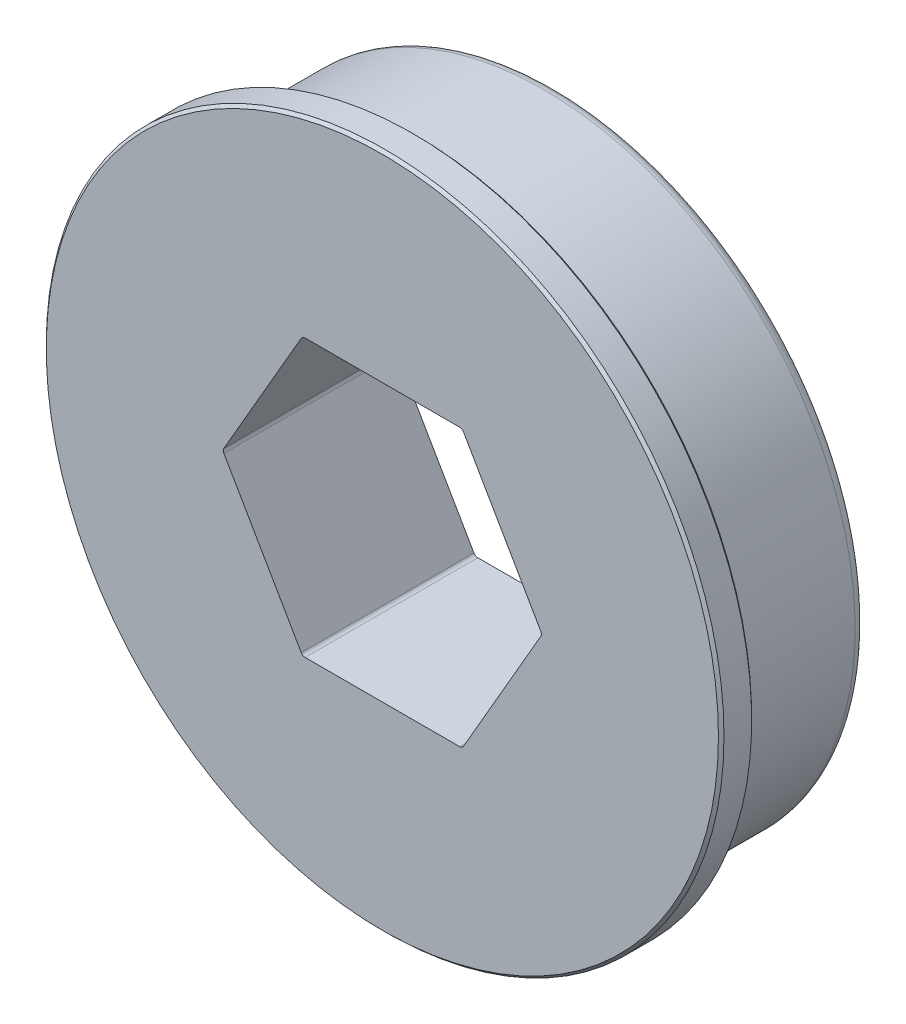
ISO-10303-21;
HEADER;
FILE_DESCRIPTION(('STEP AP214'),'2;1');
FILE_NAME('part.step','',(''),(''),'','','');
FILE_SCHEMA(('AUTOMOTIVE_DESIGN { 1 0 10303 214 1 1 1 1 }'));
ENDSEC;
DATA;
#1=APPLICATION_CONTEXT('core data for automotive mechanical design processes');
#2=APPLICATION_PROTOCOL_DEFINITION('international standard','automotive_design',2000,#1);
#3=PRODUCT_CONTEXT('',#1,'mechanical');
#4=PRODUCT('Part','Part','',(#3));
#5=PRODUCT_RELATED_PRODUCT_CATEGORY('part','',(#4));
#6=PRODUCT_DEFINITION_FORMATION('','',#4);
#7=PRODUCT_DEFINITION_CONTEXT('part definition',#1,'design');
#8=PRODUCT_DEFINITION('design','',#6,#7);
#9=PRODUCT_DEFINITION_SHAPE('','',#8);
#10=(LENGTH_UNIT() NAMED_UNIT(*) SI_UNIT(.MILLI.,.METRE.));
#11=(NAMED_UNIT(*) PLANE_ANGLE_UNIT() SI_UNIT($,.RADIAN.));
#12=(NAMED_UNIT(*) SI_UNIT($,.STERADIAN.) SOLID_ANGLE_UNIT());
#13=UNCERTAINTY_MEASURE_WITH_UNIT(LENGTH_MEASURE(1.E-05),#10,'distance_accuracy_value','');
#14=(GEOMETRIC_REPRESENTATION_CONTEXT(3) GLOBAL_UNCERTAINTY_ASSIGNED_CONTEXT((#13)) GLOBAL_UNIT_ASSIGNED_CONTEXT((#10,
#11,#12)) REPRESENTATION_CONTEXT('',''));
#15=CARTESIAN_POINT('',(0.,0.,0.));
#16=DIRECTION('',(0.,0.,1.));
#17=DIRECTION('',(1.,0.,0.));
#18=AXIS2_PLACEMENT_3D('',#15,#16,#17);
#19=CARTESIAN_POINT('',(0.,0.,7.92734));
#20=DIRECTION('',(0.,0.,-1.));
#21=DIRECTION('',(-1.,0.,0.));
#22=AXIS2_PLACEMENT_3D('',#19,#20,#21);
#23=CYLINDRICAL_SURFACE('',#22,15.5575);
#24=CARTESIAN_POINT('',(0.,0.,7.80034));
#25=DIRECTION('',(0.,0.,1.));
#26=DIRECTION('',(1.,0.,0.));
#27=AXIS2_PLACEMENT_3D('',#24,#25,#26);
#28=CIRCLE('',#27,15.5575);
#29=CARTESIAN_POINT('',(15.5575,0.,7.80034));
#30=VERTEX_POINT('',#29);
#31=EDGE_CURVE('E182',#30,#30,#28,.F.);
#32=ORIENTED_EDGE('',*,*,#31,.T.);
#33=EDGE_LOOP('',(#32));
#34=FACE_BOUND('',#33,.T.);
#35=CARTESIAN_POINT('',(0.,0.,6.53034000000001));
#36=DIRECTION('',(0.,0.,-1.));
#37=DIRECTION('',(-1.,0.,0.));
#38=AXIS2_PLACEMENT_3D('',#35,#36,#37);
#39=CIRCLE('',#38,15.5575);
#40=CARTESIAN_POINT('',(-15.5575,0.,6.53034000000001));
#41=VERTEX_POINT('',#40);
#42=EDGE_CURVE('E179',#41,#41,#39,.F.);
#43=ORIENTED_EDGE('',*,*,#42,.T.);
#44=EDGE_LOOP('',(#43));
#45=FACE_BOUND('',#44,.T.);
#46=ADVANCED_FACE('F32',(#34,#45),#23,.T.);
#47=CARTESIAN_POINT('',(15.5575,0.,7.92734));
#48=DIRECTION('',(0.,0.,1.));
#49=DIRECTION('',(1.,0.,0.));
#50=AXIS2_PLACEMENT_3D('',#47,#48,#49);
#51=PLANE('',#50);
#52=CARTESIAN_POINT('',(0.,0.,7.92734));
#53=DIRECTION('',(0.,0.,1.));
#54=DIRECTION('',(1.,0.,0.));
#55=AXIS2_PLACEMENT_3D('',#52,#53,#54);
#56=CIRCLE('',#55,15.4305);
#57=CARTESIAN_POINT('',(15.4305,0.,7.92734));
#58=VERTEX_POINT('',#57);
#59=EDGE_CURVE('E185',#58,#58,#56,.T.);
#60=ORIENTED_EDGE('',*,*,#59,.T.);
#61=EDGE_LOOP('',(#60));
#62=FACE_BOUND('',#61,.T.);
#63=DIRECTION('',(-0.5,0.866025403784438,0.));
#64=VECTOR('',#63,1.);
#65=CARTESIAN_POINT('',(-3.66617420935411,-6.35000000000001,7.92734));
#66=LINE('',#65,#64);
#67=CARTESIAN_POINT('',(-3.72483299670378,-6.24840000000001,7.92734));
#68=VERTEX_POINT('',#67);
#69=CARTESIAN_POINT('',(-7.27368963135857,-0.101600000000006,7.92734));
#70=VERTEX_POINT('',#69);
#71=EDGE_CURVE('E170',#68,#70,#66,.T.);
#72=ORIENTED_EDGE('',*,*,#71,.T.);
#73=CARTESIAN_POINT('',(-7.09771326930958,0.,7.92734));
#74=DIRECTION('',(0.,0.,1.));
#75=DIRECTION('',(1.,0.,0.));
#76=AXIS2_PLACEMENT_3D('',#73,#74,#75);
#77=CIRCLE('',#76,0.2032);
#78=CARTESIAN_POINT('',(-7.27368963135857,0.101599999999993,7.92734));
#79=VERTEX_POINT('',#78);
#80=EDGE_CURVE('E54',#70,#79,#77,.F.);
#81=ORIENTED_EDGE('',*,*,#80,.T.);
#82=DIRECTION('',(0.5,0.866025403784439,0.));
#83=VECTOR('',#82,1.);
#84=CARTESIAN_POINT('',(-7.33234841870824,0.,7.92734));
#85=LINE('',#84,#83);
#86=CARTESIAN_POINT('',(-3.72483299670379,6.24839999999999,7.92734));
#87=VERTEX_POINT('',#86);
#88=EDGE_CURVE('E165',#79,#87,#85,.T.);
#89=ORIENTED_EDGE('',*,*,#88,.T.);
#90=CARTESIAN_POINT('',(-3.54885663465479,6.14679999999999,7.92734));
#91=DIRECTION('',(0.,0.,1.));
#92=DIRECTION('',(1.,0.,0.));
#93=AXIS2_PLACEMENT_3D('',#90,#91,#92);
#94=CIRCLE('',#93,0.2032);
#95=CARTESIAN_POINT('',(-3.54885663465479,6.34999999999999,7.92734));
#96=VERTEX_POINT('',#95);
#97=EDGE_CURVE('E11',#87,#96,#94,.F.);
#98=ORIENTED_EDGE('',*,*,#97,.T.);
#99=DIRECTION('',(1.,0.,0.));
#100=VECTOR('',#99,1.);
#101=CARTESIAN_POINT('',(-3.66617420935412,6.34999999999999,7.92734));
#102=LINE('',#101,#100);
#103=CARTESIAN_POINT('',(3.5488566346548,6.35,7.92734));
#104=VERTEX_POINT('',#103);
#105=EDGE_CURVE('E238',#96,#104,#102,.T.);
#106=ORIENTED_EDGE('',*,*,#105,.T.);
#107=CARTESIAN_POINT('',(3.5488566346548,6.1468,7.92734));
#108=DIRECTION('',(0.,0.,1.));
#109=DIRECTION('',(1.,0.,0.));
#110=AXIS2_PLACEMENT_3D('',#107,#108,#109);
#111=CIRCLE('',#110,0.2032);
#112=CARTESIAN_POINT('',(3.72483299670379,6.2484,7.92734));
#113=VERTEX_POINT('',#112);
#114=EDGE_CURVE('E132',#104,#113,#111,.F.);
#115=ORIENTED_EDGE('',*,*,#114,.T.);
#116=DIRECTION('',(0.5,-0.866025403784438,0.));
#117=VECTOR('',#116,1.);
#118=CARTESIAN_POINT('',(3.66617420935413,6.35,7.92734));
#119=LINE('',#118,#117);
#120=CARTESIAN_POINT('',(7.27368963135859,0.101599999999997,7.92734));
#121=VERTEX_POINT('',#120);
#122=EDGE_CURVE('E142',#113,#121,#119,.T.);
#123=ORIENTED_EDGE('',*,*,#122,.T.);
#124=CARTESIAN_POINT('',(7.09771326930959,0.,7.92734));
#125=DIRECTION('',(0.,0.,1.));
#126=DIRECTION('',(1.,0.,0.));
#127=AXIS2_PLACEMENT_3D('',#124,#125,#126);
#128=CIRCLE('',#127,0.2032);
#129=CARTESIAN_POINT('',(7.27368963135859,-0.101600000000005,7.92734));
#130=VERTEX_POINT('',#129);
#131=EDGE_CURVE('E218',#121,#130,#128,.F.);
#132=ORIENTED_EDGE('',*,*,#131,.T.);
#133=DIRECTION('',(-0.5,-0.866025403784439,0.));
#134=VECTOR('',#133,1.);
#135=CARTESIAN_POINT('',(7.33234841870825,0.,7.92734));
#136=LINE('',#135,#134);
#137=CARTESIAN_POINT('',(3.7248329967038,-6.24840000000001,7.92734));
#138=VERTEX_POINT('',#137);
#139=EDGE_CURVE('E242',#130,#138,#136,.T.);
#140=ORIENTED_EDGE('',*,*,#139,.T.);
#141=CARTESIAN_POINT('',(3.5488566346548,-6.14680000000001,7.92734));
#142=DIRECTION('',(0.,0.,1.));
#143=DIRECTION('',(1.,0.,0.));
#144=AXIS2_PLACEMENT_3D('',#141,#142,#143);
#145=CIRCLE('',#144,0.2032);
#146=CARTESIAN_POINT('',(3.5488566346548,-6.35000000000001,7.92734));
#147=VERTEX_POINT('',#146);
#148=EDGE_CURVE('E222',#138,#147,#145,.F.);
#149=ORIENTED_EDGE('',*,*,#148,.T.);
#150=DIRECTION('',(-1.,0.,0.));
#151=VECTOR('',#150,1.);
#152=CARTESIAN_POINT('',(3.66617420935413,-6.35000000000001,7.92734));
#153=LINE('',#152,#151);
#154=CARTESIAN_POINT('',(-3.54885663465478,-6.35000000000001,7.92734));
#155=VERTEX_POINT('',#154);
#156=EDGE_CURVE('E248',#147,#155,#153,.T.);
#157=ORIENTED_EDGE('',*,*,#156,.T.);
#158=CARTESIAN_POINT('',(-3.54885663465478,-6.14680000000001,7.92734));
#159=DIRECTION('',(0.,0.,1.));
#160=DIRECTION('',(1.,0.,0.));
#161=AXIS2_PLACEMENT_3D('',#158,#159,#160);
#162=CIRCLE('',#161,0.2032);
#163=EDGE_CURVE('E226',#155,#68,#162,.F.);
#164=ORIENTED_EDGE('',*,*,#163,.T.);
#165=EDGE_LOOP('',(#72,#81,#89,#98,#106,#115,#123,#132,#140,#149,#157,#164));
#166=FACE_BOUND('',#165,.T.);
#167=ADVANCED_FACE('F237',(#62,#166),#51,.T.);
#168=CARTESIAN_POINT('',(0.,0.,0.));
#169=DIRECTION('',(0.,0.,-1.));
#170=DIRECTION('',(-1.,0.,0.));
#171=AXIS2_PLACEMENT_3D('',#168,#169,#170);
#172=PLANE('',#171);
#173=CARTESIAN_POINT('',(0.,0.,0.));
#174=DIRECTION('',(0.,0.,-1.));
#175=DIRECTION('',(-1.,0.,0.));
#176=AXIS2_PLACEMENT_3D('',#173,#174,#175);
#177=CIRCLE('',#176,13.7795);
#178=CARTESIAN_POINT('',(-13.7795,0.,0.));
#179=VERTEX_POINT('',#178);
#180=EDGE_CURVE('E188',#179,#179,#177,.T.);
#181=ORIENTED_EDGE('',*,*,#180,.T.);
#182=EDGE_LOOP('',(#181));
#183=FACE_BOUND('',#182,.T.);
#184=DIRECTION('',(0.5,0.866025403784439,0.));
#185=VECTOR('',#184,1.);
#186=CARTESIAN_POINT('',(-7.33234841870824,0.,0.));
#187=LINE('',#186,#185);
#188=CARTESIAN_POINT('',(-7.27368963135857,0.101599999999993,0.));
#189=VERTEX_POINT('',#188);
#190=CARTESIAN_POINT('',(-3.72483299670379,6.24839999999999,0.));
#191=VERTEX_POINT('',#190);
#192=EDGE_CURVE('E156',#189,#191,#187,.T.);
#193=ORIENTED_EDGE('',*,*,#192,.F.);
#194=CARTESIAN_POINT('',(-7.09771326930958,0.,0.));
#195=DIRECTION('',(0.,0.,-1.));
#196=DIRECTION('',(-1.,0.,0.));
#197=AXIS2_PLACEMENT_3D('',#194,#195,#196);
#198=CIRCLE('',#197,0.2032);
#199=CARTESIAN_POINT('',(-7.27368963135857,-0.101600000000006,0.));
#200=VERTEX_POINT('',#199);
#201=EDGE_CURVE('E228',#189,#200,#198,.F.);
#202=ORIENTED_EDGE('',*,*,#201,.T.);
#203=DIRECTION('',(-0.5,0.866025403784438,0.));
#204=VECTOR('',#203,1.);
#205=CARTESIAN_POINT('',(-3.66617420935411,-6.35000000000001,0.));
#206=LINE('',#205,#204);
#207=CARTESIAN_POINT('',(-3.72483299670378,-6.24840000000001,0.));
#208=VERTEX_POINT('',#207);
#209=EDGE_CURVE('E162',#208,#200,#206,.T.);
#210=ORIENTED_EDGE('',*,*,#209,.F.);
#211=CARTESIAN_POINT('',(-3.54885663465478,-6.14680000000001,0.));
#212=DIRECTION('',(0.,0.,-1.));
#213=DIRECTION('',(-1.,0.,0.));
#214=AXIS2_PLACEMENT_3D('',#211,#212,#213);
#215=CIRCLE('',#214,0.2032);
#216=CARTESIAN_POINT('',(-3.54885663465478,-6.35000000000001,0.));
#217=VERTEX_POINT('',#216);
#218=EDGE_CURVE('E224',#208,#217,#215,.F.);
#219=ORIENTED_EDGE('',*,*,#218,.T.);
#220=DIRECTION('',(-1.,0.,0.));
#221=VECTOR('',#220,1.);
#222=CARTESIAN_POINT('',(3.66617420935413,-6.35000000000001,0.));
#223=LINE('',#222,#221);
#224=CARTESIAN_POINT('',(3.5488566346548,-6.35000000000001,0.));
#225=VERTEX_POINT('',#224);
#226=EDGE_CURVE('E154',#225,#217,#223,.T.);
#227=ORIENTED_EDGE('',*,*,#226,.F.);
#228=CARTESIAN_POINT('',(3.5488566346548,-6.14680000000001,0.));
#229=DIRECTION('',(0.,0.,-1.));
#230=DIRECTION('',(-1.,0.,0.));
#231=AXIS2_PLACEMENT_3D('',#228,#229,#230);
#232=CIRCLE('',#231,0.2032);
#233=CARTESIAN_POINT('',(3.7248329967038,-6.24840000000001,0.));
#234=VERTEX_POINT('',#233);
#235=EDGE_CURVE('E220',#225,#234,#232,.F.);
#236=ORIENTED_EDGE('',*,*,#235,.T.);
#237=DIRECTION('',(-0.5,-0.866025403784439,0.));
#238=VECTOR('',#237,1.);
#239=CARTESIAN_POINT('',(7.33234841870825,0.,0.));
#240=LINE('',#239,#238);
#241=CARTESIAN_POINT('',(7.27368963135859,-0.101600000000005,0.));
#242=VERTEX_POINT('',#241);
#243=EDGE_CURVE('E150',#242,#234,#240,.T.);
#244=ORIENTED_EDGE('',*,*,#243,.F.);
#245=CARTESIAN_POINT('',(7.09771326930959,0.,0.));
#246=DIRECTION('',(0.,0.,-1.));
#247=DIRECTION('',(-1.,0.,0.));
#248=AXIS2_PLACEMENT_3D('',#245,#246,#247);
#249=CIRCLE('',#248,0.2032);
#250=CARTESIAN_POINT('',(7.27368963135859,0.101599999999997,0.));
#251=VERTEX_POINT('',#250);
#252=EDGE_CURVE('E149',#242,#251,#249,.F.);
#253=ORIENTED_EDGE('',*,*,#252,.T.);
#254=DIRECTION('',(0.5,-0.866025403784438,0.));
#255=VECTOR('',#254,1.);
#256=CARTESIAN_POINT('',(3.66617420935413,6.35,0.));
#257=LINE('',#256,#255);
#258=CARTESIAN_POINT('',(3.72483299670379,6.2484,0.));
#259=VERTEX_POINT('',#258);
#260=EDGE_CURVE('E139',#259,#251,#257,.T.);
#261=ORIENTED_EDGE('',*,*,#260,.F.);
#262=CARTESIAN_POINT('',(3.5488566346548,6.1468,0.));
#263=DIRECTION('',(0.,0.,-1.));
#264=DIRECTION('',(-1.,0.,0.));
#265=AXIS2_PLACEMENT_3D('',#262,#263,#264);
#266=CIRCLE('',#265,0.2032);
#267=CARTESIAN_POINT('',(3.5488566346548,6.35,0.));
#268=VERTEX_POINT('',#267);
#269=EDGE_CURVE('E122',#259,#268,#266,.F.);
#270=ORIENTED_EDGE('',*,*,#269,.T.);
#271=DIRECTION('',(1.,0.,0.));
#272=VECTOR('',#271,1.);
#273=CARTESIAN_POINT('',(-3.66617420935412,6.34999999999999,0.));
#274=LINE('',#273,#272);
#275=CARTESIAN_POINT('',(-3.54885663465479,6.34999999999999,0.));
#276=VERTEX_POINT('',#275);
#277=EDGE_CURVE('E151',#276,#268,#274,.T.);
#278=ORIENTED_EDGE('',*,*,#277,.F.);
#279=CARTESIAN_POINT('',(-3.54885663465479,6.14679999999999,0.));
#280=DIRECTION('',(0.,0.,-1.));
#281=DIRECTION('',(-1.,0.,0.));
#282=AXIS2_PLACEMENT_3D('',#279,#280,#281);
#283=CIRCLE('',#282,0.2032);
#284=EDGE_CURVE('E40',#276,#191,#283,.F.);
#285=ORIENTED_EDGE('',*,*,#284,.T.);
#286=EDGE_LOOP('',(#193,#202,#210,#219,#227,#236,#244,#253,#261,#270,#278,#285));
#287=FACE_BOUND('',#286,.T.);
#288=ADVANCED_FACE('F147',(#183,#287),#172,.T.);
#289=CARTESIAN_POINT('',(0.,0.,7.92734));
#290=DIRECTION('',(0.,0.,-1.));
#291=DIRECTION('',(-1.,0.,0.));
#292=AXIS2_PLACEMENT_3D('',#289,#290,#291);
#293=CYLINDRICAL_SURFACE('',#292,14.2875);
#294=CARTESIAN_POINT('',(0.,0.,0.508));
#295=DIRECTION('',(0.,0.,-1.));
#296=DIRECTION('',(-1.,0.,0.));
#297=AXIS2_PLACEMENT_3D('',#294,#295,#296);
#298=CIRCLE('',#297,14.2875);
#299=CARTESIAN_POINT('',(-14.2875,0.,0.508));
#300=VERTEX_POINT('',#299);
#301=EDGE_CURVE('E191',#300,#300,#298,.F.);
#302=ORIENTED_EDGE('',*,*,#301,.T.);
#303=EDGE_LOOP('',(#302));
#304=FACE_BOUND('',#303,.T.);
#305=CARTESIAN_POINT('',(0.,0.,5.89534));
#306=DIRECTION('',(0.,0.,-1.));
#307=DIRECTION('',(-1.,0.,0.));
#308=AXIS2_PLACEMENT_3D('',#305,#306,#307);
#309=CIRCLE('',#308,14.2875);
#310=CARTESIAN_POINT('',(-14.2875,0.,5.89534));
#311=VERTEX_POINT('',#310);
#312=EDGE_CURVE('E173',#311,#311,#309,.T.);
#313=ORIENTED_EDGE('',*,*,#312,.T.);
#314=EDGE_LOOP('',(#313));
#315=FACE_BOUND('',#314,.T.);
#316=ADVANCED_FACE('F316',(#304,#315),#293,.T.);
#317=CARTESIAN_POINT('',(14.2875,0.,5.89534));
#318=DIRECTION('',(0.,0.,1.));
#319=DIRECTION('',(1.,0.,0.));
#320=AXIS2_PLACEMENT_3D('',#317,#318,#319);
#321=PLANE('',#320);
#322=CARTESIAN_POINT('',(0.,0.,5.89534));
#323=DIRECTION('',(0.,0.,-1.));
#324=DIRECTION('',(-1.,0.,0.));
#325=AXIS2_PLACEMENT_3D('',#322,#323,#324);
#326=CIRCLE('',#325,13.97);
#327=CARTESIAN_POINT('',(-13.97,0.,5.89534));
#328=VERTEX_POINT('',#327);
#329=EDGE_CURVE('E169',#328,#328,#326,.T.);
#330=ORIENTED_EDGE('',*,*,#329,.T.);
#331=EDGE_LOOP('',(#330));
#332=FACE_BOUND('',#331,.T.);
#333=ORIENTED_EDGE('',*,*,#312,.F.);
#334=EDGE_LOOP('',(#333));
#335=FACE_BOUND('',#334,.T.);
#336=ADVANCED_FACE('F320',(#332,#335),#321,.T.);
#337=CARTESIAN_POINT('',(0.,0.,7.92734));
#338=DIRECTION('',(0.,0.,-1.));
#339=DIRECTION('',(-1.,0.,0.));
#340=AXIS2_PLACEMENT_3D('',#337,#338,#339);
#341=CYLINDRICAL_SURFACE('',#340,13.97);
#342=CARTESIAN_POINT('',(0.,0.,6.40333999999999));
#343=DIRECTION('',(0.,0.,-1.));
#344=DIRECTION('',(-1.,0.,0.));
#345=AXIS2_PLACEMENT_3D('',#342,#343,#344);
#346=CIRCLE('',#345,13.97);
#347=CARTESIAN_POINT('',(-13.97,0.,6.40333999999999));
#348=VERTEX_POINT('',#347);
#349=EDGE_CURVE('E166',#348,#348,#346,.T.);
#350=ORIENTED_EDGE('',*,*,#349,.T.);
#351=EDGE_LOOP('',(#350));
#352=FACE_BOUND('',#351,.T.);
#353=ORIENTED_EDGE('',*,*,#329,.F.);
#354=EDGE_LOOP('',(#353));
#355=FACE_BOUND('',#354,.T.);
#356=ADVANCED_FACE('F326',(#352,#355),#341,.T.);
#357=CARTESIAN_POINT('',(13.97,0.,6.40334));
#358=DIRECTION('',(0.,0.,-1.));
#359=DIRECTION('',(-1.,0.,0.));
#360=AXIS2_PLACEMENT_3D('',#357,#358,#359);
#361=PLANE('',#360);
#362=CARTESIAN_POINT('',(0.,0.,6.40334));
#363=DIRECTION('',(0.,0.,-1.));
#364=DIRECTION('',(-1.,0.,0.));
#365=AXIS2_PLACEMENT_3D('',#362,#363,#364);
#366=CIRCLE('',#365,15.4305);
#367=CARTESIAN_POINT('',(-15.4305,0.,6.40334));
#368=VERTEX_POINT('',#367);
#369=EDGE_CURVE('E176',#368,#368,#366,.T.);
#370=ORIENTED_EDGE('',*,*,#369,.T.);
#371=EDGE_LOOP('',(#370));
#372=FACE_BOUND('',#371,.T.);
#373=ORIENTED_EDGE('',*,*,#349,.F.);
#374=EDGE_LOOP('',(#373));
#375=FACE_BOUND('',#374,.T.);
#376=ADVANCED_FACE('F330',(#372,#375),#361,.T.);
#377=CARTESIAN_POINT('',(-7.33234841870824,0.,7.92734));
#378=DIRECTION('',(-0.866025403784439,0.5,0.));
#379=DIRECTION('',(-0.5,-0.866025403784439,0.));
#380=AXIS2_PLACEMENT_3D('',#377,#378,#379);
#381=PLANE('',#380);
#382=ORIENTED_EDGE('',*,*,#88,.F.);
#383=DIRECTION('',(0.,0.,-1.));
#384=VECTOR('',#383,1.);
#385=CARTESIAN_POINT('',(-7.27368963135857,0.101599999999994,0.));
#386=LINE('',#385,#384);
#387=EDGE_CURVE('E133',#79,#189,#386,.T.);
#388=ORIENTED_EDGE('',*,*,#387,.T.);
#389=ORIENTED_EDGE('',*,*,#192,.T.);
#390=DIRECTION('',(0.,0.,-1.));
#391=VECTOR('',#390,1.);
#392=CARTESIAN_POINT('',(-3.72483299670378,6.24839999999999,7.92734));
#393=LINE('',#392,#391);
#394=EDGE_CURVE('E47',#191,#87,#393,.F.);
#395=ORIENTED_EDGE('',*,*,#394,.T.);
#396=EDGE_LOOP('',(#382,#388,#389,#395));
#397=FACE_BOUND('',#396,.T.);
#398=ADVANCED_FACE('F232',(#397),#381,.F.);
#399=CARTESIAN_POINT('',(-3.66617420935411,-6.35000000000001,7.92734));
#400=DIRECTION('',(-0.866025403784438,-0.5,0.));
#401=DIRECTION('',(0.5,-0.866025403784439,0.));
#402=AXIS2_PLACEMENT_3D('',#399,#400,#401);
#403=PLANE('',#402);
#404=ORIENTED_EDGE('',*,*,#71,.F.);
#405=DIRECTION('',(0.,0.,-1.));
#406=VECTOR('',#405,1.);
#407=CARTESIAN_POINT('',(-3.72483299670378,-6.24840000000001,0.));
#408=LINE('',#407,#406);
#409=EDGE_CURVE('E210',#68,#208,#408,.T.);
#410=ORIENTED_EDGE('',*,*,#409,.T.);
#411=ORIENTED_EDGE('',*,*,#209,.T.);
#412=DIRECTION('',(0.,0.,-1.));
#413=VECTOR('',#412,1.);
#414=CARTESIAN_POINT('',(-7.27368963135857,-0.101600000000006,7.92734));
#415=LINE('',#414,#413);
#416=EDGE_CURVE('E208',#200,#70,#415,.F.);
#417=ORIENTED_EDGE('',*,*,#416,.T.);
#418=EDGE_LOOP('',(#404,#410,#411,#417));
#419=FACE_BOUND('',#418,.T.);
#420=ADVANCED_FACE('F259',(#419),#403,.F.);
#421=CARTESIAN_POINT('',(3.66617420935413,-6.35000000000001,7.92734));
#422=DIRECTION('',(0.,-1.,0.));
#423=DIRECTION('',(0.,0.,-1.));
#424=AXIS2_PLACEMENT_3D('',#421,#422,#423);
#425=PLANE('',#424);
#426=ORIENTED_EDGE('',*,*,#156,.F.);
#427=DIRECTION('',(0.,0.,-1.));
#428=VECTOR('',#427,1.);
#429=CARTESIAN_POINT('',(3.5488566346548,-6.35000000000001,0.));
#430=LINE('',#429,#428);
#431=EDGE_CURVE('E205',#147,#225,#430,.T.);
#432=ORIENTED_EDGE('',*,*,#431,.T.);
#433=ORIENTED_EDGE('',*,*,#226,.T.);
#434=DIRECTION('',(0.,0.,-1.));
#435=VECTOR('',#434,1.);
#436=CARTESIAN_POINT('',(-3.54885663465478,-6.35000000000001,7.92734));
#437=LINE('',#436,#435);
#438=EDGE_CURVE('E203',#217,#155,#437,.F.);
#439=ORIENTED_EDGE('',*,*,#438,.T.);
#440=EDGE_LOOP('',(#426,#432,#433,#439));
#441=FACE_BOUND('',#440,.T.);
#442=ADVANCED_FACE('F266',(#441),#425,.F.);
#443=CARTESIAN_POINT('',(7.33234841870825,0.,7.92734));
#444=DIRECTION('',(0.866025403784439,-0.5,0.));
#445=DIRECTION('',(0.5,0.866025403784439,0.));
#446=AXIS2_PLACEMENT_3D('',#443,#444,#445);
#447=PLANE('',#446);
#448=ORIENTED_EDGE('',*,*,#139,.F.);
#449=DIRECTION('',(0.,0.,-1.));
#450=VECTOR('',#449,1.);
#451=CARTESIAN_POINT('',(7.27368963135859,-0.101600000000005,0.));
#452=LINE('',#451,#450);
#453=EDGE_CURVE('E200',#130,#242,#452,.T.);
#454=ORIENTED_EDGE('',*,*,#453,.T.);
#455=ORIENTED_EDGE('',*,*,#243,.T.);
#456=DIRECTION('',(0.,0.,-1.));
#457=VECTOR('',#456,1.);
#458=CARTESIAN_POINT('',(3.7248329967038,-6.24840000000001,7.92734));
#459=LINE('',#458,#457);
#460=EDGE_CURVE('E198',#234,#138,#459,.F.);
#461=ORIENTED_EDGE('',*,*,#460,.T.);
#462=EDGE_LOOP('',(#448,#454,#455,#461));
#463=FACE_BOUND('',#462,.T.);
#464=ADVANCED_FACE('F274',(#463),#447,.F.);
#465=CARTESIAN_POINT('',(3.66617420935413,6.35,7.92734));
#466=DIRECTION('',(0.866025403784439,0.5,0.));
#467=DIRECTION('',(-0.5,0.866025403784439,0.));
#468=AXIS2_PLACEMENT_3D('',#465,#466,#467);
#469=PLANE('',#468);
#470=ORIENTED_EDGE('',*,*,#122,.F.);
#471=DIRECTION('',(0.,0.,-1.));
#472=VECTOR('',#471,1.);
#473=CARTESIAN_POINT('',(3.72483299670379,6.2484,0.));
#474=LINE('',#473,#472);
#475=EDGE_CURVE('E126',#113,#259,#474,.T.);
#476=ORIENTED_EDGE('',*,*,#475,.T.);
#477=ORIENTED_EDGE('',*,*,#260,.T.);
#478=DIRECTION('',(0.,0.,-1.));
#479=VECTOR('',#478,1.);
#480=CARTESIAN_POINT('',(7.27368963135859,0.101599999999995,7.92734));
#481=LINE('',#480,#479);
#482=EDGE_CURVE('E144',#251,#121,#481,.F.);
#483=ORIENTED_EDGE('',*,*,#482,.T.);
#484=EDGE_LOOP('',(#470,#476,#477,#483));
#485=FACE_BOUND('',#484,.T.);
#486=ADVANCED_FACE('F138',(#485),#469,.F.);
#487=CARTESIAN_POINT('',(-3.66617420935412,6.34999999999999,7.92734));
#488=DIRECTION('',(0.,1.,0.));
#489=DIRECTION('',(-1.,0.,0.));
#490=AXIS2_PLACEMENT_3D('',#487,#488,#489);
#491=PLANE('',#490);
#492=ORIENTED_EDGE('',*,*,#277,.T.);
#493=DIRECTION('',(0.,0.,-1.));
#494=VECTOR('',#493,1.);
#495=CARTESIAN_POINT('',(3.5488566346548,6.35,7.92734));
#496=LINE('',#495,#494);
#497=EDGE_CURVE('E127',#268,#104,#496,.F.);
#498=ORIENTED_EDGE('',*,*,#497,.T.);
#499=ORIENTED_EDGE('',*,*,#105,.F.);
#500=DIRECTION('',(0.,0.,-1.));
#501=VECTOR('',#500,1.);
#502=CARTESIAN_POINT('',(-3.54885663465479,6.34999999999999,0.));
#503=LINE('',#502,#501);
#504=EDGE_CURVE('E143',#96,#276,#503,.T.);
#505=ORIENTED_EDGE('',*,*,#504,.T.);
#506=EDGE_LOOP('',(#492,#498,#499,#505));
#507=FACE_BOUND('',#506,.T.);
#508=ADVANCED_FACE('F240',(#507),#491,.F.);
#509=CARTESIAN_POINT('',(0.,0.,6.40334));
#510=DIRECTION('',(0.,0.,1.));
#511=DIRECTION('',(1.,0.,0.));
#512=AXIS2_PLACEMENT_3D('',#509,#510,#511);
#513=CONICAL_SURFACE('',#512,15.4305,0.785398163397469);
#514=ORIENTED_EDGE('',*,*,#42,.F.);
#515=EDGE_LOOP('',(#514));
#516=FACE_BOUND('',#515,.T.);
#517=ORIENTED_EDGE('',*,*,#369,.F.);
#518=EDGE_LOOP('',(#517));
#519=FACE_BOUND('',#518,.T.);
#520=ADVANCED_FACE('F299',(#516,#519),#513,.T.);
#521=CARTESIAN_POINT('',(0.,0.,7.80034));
#522=DIRECTION('',(0.,0.,-1.));
#523=DIRECTION('',(-1.,0.,0.));
#524=AXIS2_PLACEMENT_3D('',#521,#522,#523);
#525=CONICAL_SURFACE('',#524,15.5575,0.785398163397442);
#526=ORIENTED_EDGE('',*,*,#59,.F.);
#527=EDGE_LOOP('',(#526));
#528=FACE_BOUND('',#527,.T.);
#529=ORIENTED_EDGE('',*,*,#31,.F.);
#530=EDGE_LOOP('',(#529));
#531=FACE_BOUND('',#530,.T.);
#532=ADVANCED_FACE('F302',(#528,#531),#525,.T.);
#533=CARTESIAN_POINT('',(0.,0.,0.508));
#534=DIRECTION('',(0.,0.,-1.));
#535=DIRECTION('',(-1.,0.,0.));
#536=AXIS2_PLACEMENT_3D('',#533,#534,#535);
#537=TOROIDAL_SURFACE('',#536,13.7795,0.508);
#538=ORIENTED_EDGE('',*,*,#301,.F.);
#539=EDGE_LOOP('',(#538));
#540=FACE_BOUND('',#539,.T.);
#541=ORIENTED_EDGE('',*,*,#180,.F.);
#542=EDGE_LOOP('',(#541));
#543=FACE_BOUND('',#542,.T.);
#544=ADVANCED_FACE('F286',(#540,#543),#537,.T.);
#545=CARTESIAN_POINT('',(3.5488566346548,6.1468,7.92734));
#546=DIRECTION('',(0.,0.,1.));
#547=DIRECTION('',(1.,0.,0.));
#548=AXIS2_PLACEMENT_3D('',#545,#546,#547);
#549=CYLINDRICAL_SURFACE('',#548,0.2032);
#550=ORIENTED_EDGE('',*,*,#114,.F.);
#551=ORIENTED_EDGE('',*,*,#497,.F.);
#552=ORIENTED_EDGE('',*,*,#269,.F.);
#553=ORIENTED_EDGE('',*,*,#475,.F.);
#554=EDGE_LOOP('',(#550,#551,#552,#553));
#555=FACE_BOUND('',#554,.T.);
#556=ADVANCED_FACE('F125',(#555),#549,.F.);
#557=CARTESIAN_POINT('',(7.09771326930959,0.,7.92734));
#558=DIRECTION('',(0.,0.,1.));
#559=DIRECTION('',(1.,0.,0.));
#560=AXIS2_PLACEMENT_3D('',#557,#558,#559);
#561=CYLINDRICAL_SURFACE('',#560,0.2032);
#562=ORIENTED_EDGE('',*,*,#131,.F.);
#563=ORIENTED_EDGE('',*,*,#482,.F.);
#564=ORIENTED_EDGE('',*,*,#252,.F.);
#565=ORIENTED_EDGE('',*,*,#453,.F.);
#566=EDGE_LOOP('',(#562,#563,#564,#565));
#567=FACE_BOUND('',#566,.T.);
#568=ADVANCED_FACE('F278',(#567),#561,.F.);
#569=CARTESIAN_POINT('',(3.5488566346548,-6.14680000000001,7.92734));
#570=DIRECTION('',(0.,0.,1.));
#571=DIRECTION('',(1.,0.,0.));
#572=AXIS2_PLACEMENT_3D('',#569,#570,#571);
#573=CYLINDRICAL_SURFACE('',#572,0.2032);
#574=ORIENTED_EDGE('',*,*,#148,.F.);
#575=ORIENTED_EDGE('',*,*,#460,.F.);
#576=ORIENTED_EDGE('',*,*,#235,.F.);
#577=ORIENTED_EDGE('',*,*,#431,.F.);
#578=EDGE_LOOP('',(#574,#575,#576,#577));
#579=FACE_BOUND('',#578,.T.);
#580=ADVANCED_FACE('F270',(#579),#573,.F.);
#581=CARTESIAN_POINT('',(-3.54885663465478,-6.14680000000001,7.92734));
#582=DIRECTION('',(0.,0.,1.));
#583=DIRECTION('',(1.,0.,0.));
#584=AXIS2_PLACEMENT_3D('',#581,#582,#583);
#585=CYLINDRICAL_SURFACE('',#584,0.2032);
#586=ORIENTED_EDGE('',*,*,#163,.F.);
#587=ORIENTED_EDGE('',*,*,#438,.F.);
#588=ORIENTED_EDGE('',*,*,#218,.F.);
#589=ORIENTED_EDGE('',*,*,#409,.F.);
#590=EDGE_LOOP('',(#586,#587,#588,#589));
#591=FACE_BOUND('',#590,.T.);
#592=ADVANCED_FACE('F261',(#591),#585,.F.);
#593=CARTESIAN_POINT('',(-7.09771326930958,0.,7.92734));
#594=DIRECTION('',(0.,0.,1.));
#595=DIRECTION('',(1.,0.,0.));
#596=AXIS2_PLACEMENT_3D('',#593,#594,#595);
#597=CYLINDRICAL_SURFACE('',#596,0.2032);
#598=ORIENTED_EDGE('',*,*,#80,.F.);
#599=ORIENTED_EDGE('',*,*,#416,.F.);
#600=ORIENTED_EDGE('',*,*,#201,.F.);
#601=ORIENTED_EDGE('',*,*,#387,.F.);
#602=EDGE_LOOP('',(#598,#599,#600,#601));
#603=FACE_BOUND('',#602,.T.);
#604=ADVANCED_FACE('F257',(#603),#597,.F.);
#605=CARTESIAN_POINT('',(-3.54885663465479,6.14679999999999,7.92734));
#606=DIRECTION('',(0.,0.,1.));
#607=DIRECTION('',(1.,0.,0.));
#608=AXIS2_PLACEMENT_3D('',#605,#606,#607);
#609=CYLINDRICAL_SURFACE('',#608,0.2032);
#610=ORIENTED_EDGE('',*,*,#97,.F.);
#611=ORIENTED_EDGE('',*,*,#394,.F.);
#612=ORIENTED_EDGE('',*,*,#284,.F.);
#613=ORIENTED_EDGE('',*,*,#504,.F.);
#614=EDGE_LOOP('',(#610,#611,#612,#613));
#615=FACE_BOUND('',#614,.T.);
#616=ADVANCED_FACE('F34',(#615),#609,.F.);
#617=CLOSED_SHELL('',(#46,#167,#288,#316,#336,#356,#376,#398,#420,#442,#464,#486,#508,#520,#532,
#544,#556,#568,#580,#592,#604,#616));
#618=MANIFOLD_SOLID_BREP('B2',#617);
#619=ADVANCED_BREP_SHAPE_REPRESENTATION('',(#18,#618),#14);
#620=SHAPE_DEFINITION_REPRESENTATION(#9,#619);
ENDSEC;
END-ISO-10303-21;
